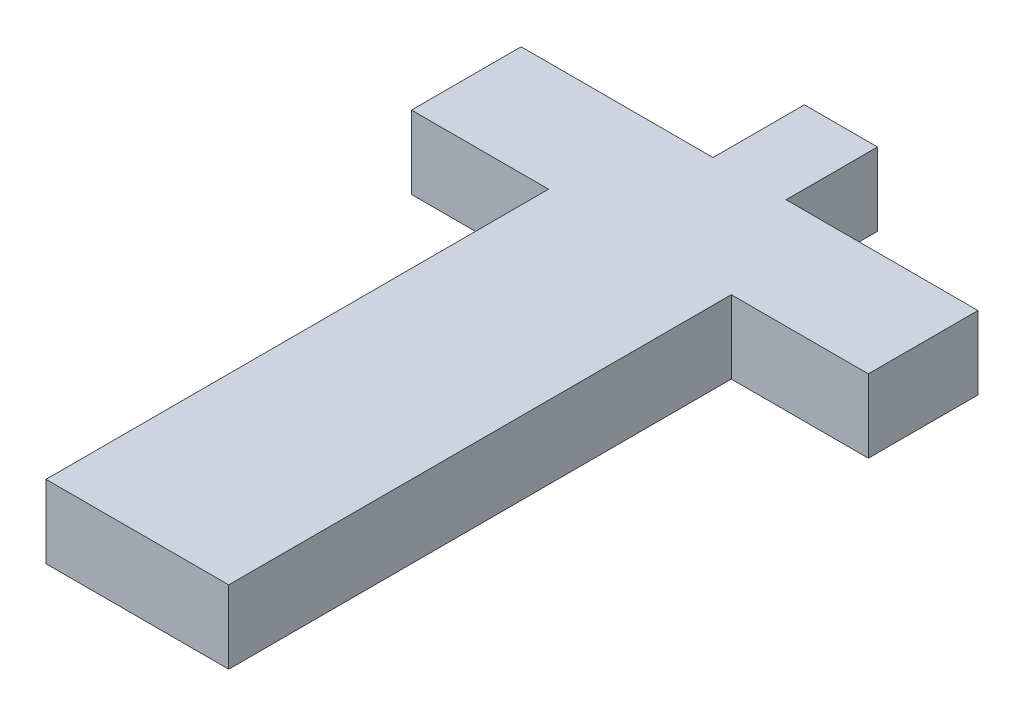
ISO-10303-21;
HEADER;
FILE_DESCRIPTION(('STEP AP214'),'2;1');
FILE_NAME('part.step','',(''),(''),'','','');
FILE_SCHEMA(('AUTOMOTIVE_DESIGN { 1 0 10303 214 1 1 1 1 }'));
ENDSEC;
DATA;
#1=APPLICATION_CONTEXT('core data for automotive mechanical design processes');
#2=APPLICATION_PROTOCOL_DEFINITION('international standard','automotive_design',2000,#1);
#3=PRODUCT_CONTEXT('',#1,'mechanical');
#4=PRODUCT('Part','Part','',(#3));
#5=PRODUCT_RELATED_PRODUCT_CATEGORY('part','',(#4));
#6=PRODUCT_DEFINITION_FORMATION('','',#4);
#7=PRODUCT_DEFINITION_CONTEXT('part definition',#1,'design');
#8=PRODUCT_DEFINITION('design','',#6,#7);
#9=PRODUCT_DEFINITION_SHAPE('','',#8);
#10=(LENGTH_UNIT() NAMED_UNIT(*) SI_UNIT(.MILLI.,.METRE.));
#11=(NAMED_UNIT(*) PLANE_ANGLE_UNIT() SI_UNIT($,.RADIAN.));
#12=(NAMED_UNIT(*) SI_UNIT($,.STERADIAN.) SOLID_ANGLE_UNIT());
#13=UNCERTAINTY_MEASURE_WITH_UNIT(LENGTH_MEASURE(1.E-05),#10,'distance_accuracy_value','');
#14=(GEOMETRIC_REPRESENTATION_CONTEXT(3) GLOBAL_UNCERTAINTY_ASSIGNED_CONTEXT((#13)) GLOBAL_UNIT_ASSIGNED_CONTEXT((#10,
#11,#12)) REPRESENTATION_CONTEXT('',''));
#15=CARTESIAN_POINT('',(0.,0.,0.));
#16=DIRECTION('',(0.,0.,1.));
#17=DIRECTION('',(1.,0.,0.));
#18=AXIS2_PLACEMENT_3D('',#15,#16,#17);
#19=CARTESIAN_POINT('',(-10.,4.,12.));
#20=DIRECTION('',(1.,0.,0.));
#21=DIRECTION('',(0.,0.,-1.));
#22=AXIS2_PLACEMENT_3D('',#19,#20,#21);
#23=PLANE('',#22);
#24=DIRECTION('',(0.,1.,0.));
#25=VECTOR('',#24,1.);
#26=CARTESIAN_POINT('',(-10.,-4.,12.));
#27=LINE('',#26,#25);
#28=CARTESIAN_POINT('',(-10.,-4.,12.));
#29=VERTEX_POINT('',#28);
#30=CARTESIAN_POINT('',(-10.,4.,12.));
#31=VERTEX_POINT('',#30);
#32=EDGE_CURVE('E47',#29,#31,#27,.T.);
#33=ORIENTED_EDGE('',*,*,#32,.F.);
#34=DIRECTION('',(0.,0.,-1.));
#35=VECTOR('',#34,1.);
#36=CARTESIAN_POINT('',(-10.,-4.,12.));
#37=LINE('',#36,#35);
#38=CARTESIAN_POINT('',(-10.,-4.,67.));
#39=VERTEX_POINT('',#38);
#40=EDGE_CURVE('E212',#39,#29,#37,.T.);
#41=ORIENTED_EDGE('',*,*,#40,.F.);
#42=DIRECTION('',(0.,-1.,0.));
#43=VECTOR('',#42,1.);
#44=CARTESIAN_POINT('',(-10.,4.,67.));
#45=LINE('',#44,#43);
#46=CARTESIAN_POINT('',(-10.,4.,67.));
#47=VERTEX_POINT('',#46);
#48=EDGE_CURVE('E172',#47,#39,#45,.T.);
#49=ORIENTED_EDGE('',*,*,#48,.F.);
#50=DIRECTION('',(0.,0.,-1.));
#51=VECTOR('',#50,1.);
#52=CARTESIAN_POINT('',(-10.,4.,12.));
#53=LINE('',#52,#51);
#54=EDGE_CURVE('E40',#47,#31,#53,.T.);
#55=ORIENTED_EDGE('',*,*,#54,.T.);
#56=EDGE_LOOP('',(#33,#41,#49,#55));
#57=FACE_BOUND('',#56,.T.);
#58=ADVANCED_FACE('F32',(#57),#23,.F.);
#59=CARTESIAN_POINT('',(10.,4.,12.));
#60=DIRECTION('',(-1.,0.,0.));
#61=DIRECTION('',(0.,0.,1.));
#62=AXIS2_PLACEMENT_3D('',#59,#60,#61);
#63=PLANE('',#62);
#64=DIRECTION('',(0.,-1.,0.));
#65=VECTOR('',#64,1.);
#66=CARTESIAN_POINT('',(10.,4.,12.));
#67=LINE('',#66,#65);
#68=CARTESIAN_POINT('',(10.,4.,12.));
#69=VERTEX_POINT('',#68);
#70=CARTESIAN_POINT('',(10.,-4.,12.));
#71=VERTEX_POINT('',#70);
#72=EDGE_CURVE('E55',#69,#71,#67,.T.);
#73=ORIENTED_EDGE('',*,*,#72,.F.);
#74=DIRECTION('',(0.,0.,-1.));
#75=VECTOR('',#74,1.);
#76=CARTESIAN_POINT('',(10.,4.,12.));
#77=LINE('',#76,#75);
#78=CARTESIAN_POINT('',(10.,4.,67.));
#79=VERTEX_POINT('',#78);
#80=EDGE_CURVE('E11',#79,#69,#77,.T.);
#81=ORIENTED_EDGE('',*,*,#80,.F.);
#82=DIRECTION('',(0.,1.,0.));
#83=VECTOR('',#82,1.);
#84=CARTESIAN_POINT('',(10.,4.,67.));
#85=LINE('',#84,#83);
#86=CARTESIAN_POINT('',(10.,-4.,67.));
#87=VERTEX_POINT('',#86);
#88=EDGE_CURVE('E166',#87,#79,#85,.T.);
#89=ORIENTED_EDGE('',*,*,#88,.F.);
#90=DIRECTION('',(0.,0.,-1.));
#91=VECTOR('',#90,1.);
#92=CARTESIAN_POINT('',(10.,-4.,12.));
#93=LINE('',#92,#91);
#94=EDGE_CURVE('E210',#87,#71,#93,.T.);
#95=ORIENTED_EDGE('',*,*,#94,.T.);
#96=EDGE_LOOP('',(#73,#81,#89,#95));
#97=FACE_BOUND('',#96,.T.);
#98=ADVANCED_FACE('F34',(#97),#63,.F.);
#99=CARTESIAN_POINT('',(0.,0.,0.));
#100=DIRECTION('',(0.,0.,1.));
#101=DIRECTION('',(1.,0.,0.));
#102=AXIS2_PLACEMENT_3D('',#99,#100,#101);
#103=PLANE('',#102);
#104=DIRECTION('',(0.,1.,0.));
#105=VECTOR('',#104,1.);
#106=CARTESIAN_POINT('',(-4.,-4.,0.));
#107=LINE('',#106,#105);
#108=CARTESIAN_POINT('',(-4.,-4.,0.));
#109=VERTEX_POINT('',#108);
#110=CARTESIAN_POINT('',(-4.,4.,0.));
#111=VERTEX_POINT('',#110);
#112=EDGE_CURVE('E178',#109,#111,#107,.T.);
#113=ORIENTED_EDGE('',*,*,#112,.F.);
#114=DIRECTION('',(1.,0.,0.));
#115=VECTOR('',#114,1.);
#116=CARTESIAN_POINT('',(-10.,-4.,0.));
#117=LINE('',#116,#115);
#118=CARTESIAN_POINT('',(-25.,-4.,0.));
#119=VERTEX_POINT('',#118);
#120=EDGE_CURVE('E207',#119,#109,#117,.T.);
#121=ORIENTED_EDGE('',*,*,#120,.F.);
#122=DIRECTION('',(0.,-1.,0.));
#123=VECTOR('',#122,1.);
#124=CARTESIAN_POINT('',(-25.,-4.,0.));
#125=LINE('',#124,#123);
#126=CARTESIAN_POINT('',(-25.,4.,0.));
#127=VERTEX_POINT('',#126);
#128=EDGE_CURVE('E131',#127,#119,#125,.T.);
#129=ORIENTED_EDGE('',*,*,#128,.F.);
#130=DIRECTION('',(-1.,0.,0.));
#131=VECTOR('',#130,1.);
#132=CARTESIAN_POINT('',(-10.,4.,0.));
#133=LINE('',#132,#131);
#134=EDGE_CURVE('E127',#111,#127,#133,.T.);
#135=ORIENTED_EDGE('',*,*,#134,.F.);
#136=EDGE_LOOP('',(#113,#121,#129,#135));
#137=FACE_BOUND('',#136,.T.);
#138=ADVANCED_FACE('F243',(#137),#103,.F.);
#139=DIRECTION('',(0.,-1.,0.));
#140=VECTOR('',#139,1.);
#141=CARTESIAN_POINT('',(4.,-4.,0.));
#142=LINE('',#141,#140);
#143=CARTESIAN_POINT('',(4.,4.,0.));
#144=VERTEX_POINT('',#143);
#145=CARTESIAN_POINT('',(4.,-4.,0.));
#146=VERTEX_POINT('',#145);
#147=EDGE_CURVE('E183',#144,#146,#142,.T.);
#148=ORIENTED_EDGE('',*,*,#147,.F.);
#149=CARTESIAN_POINT('',(25.,4.,0.));
#150=VERTEX_POINT('',#149);
#151=EDGE_CURVE('E204',#150,#144,#133,.T.);
#152=ORIENTED_EDGE('',*,*,#151,.F.);
#153=DIRECTION('',(0.,1.,0.));
#154=VECTOR('',#153,1.);
#155=CARTESIAN_POINT('',(25.,4.,0.));
#156=LINE('',#155,#154);
#157=CARTESIAN_POINT('',(25.,-4.,0.));
#158=VERTEX_POINT('',#157);
#159=EDGE_CURVE('E155',#158,#150,#156,.T.);
#160=ORIENTED_EDGE('',*,*,#159,.F.);
#161=EDGE_CURVE('E206',#146,#158,#117,.T.);
#162=ORIENTED_EDGE('',*,*,#161,.F.);
#163=EDGE_LOOP('',(#148,#152,#160,#162));
#164=FACE_BOUND('',#163,.T.);
#165=ADVANCED_FACE('F248',(#164),#103,.F.);
#166=CARTESIAN_POINT('',(-10.,4.,12.));
#167=DIRECTION('',(0.,-1.,0.));
#168=DIRECTION('',(0.,0.,-1.));
#169=AXIS2_PLACEMENT_3D('',#166,#167,#168);
#170=PLANE('',#169);
#171=ORIENTED_EDGE('',*,*,#151,.T.);
#172=DIRECTION('',(0.,0.,1.));
#173=VECTOR('',#172,1.);
#174=CARTESIAN_POINT('',(4.,4.,-10.));
#175=LINE('',#174,#173);
#176=CARTESIAN_POINT('',(4.,4.,-10.));
#177=VERTEX_POINT('',#176);
#178=EDGE_CURVE('E199',#177,#144,#175,.T.);
#179=ORIENTED_EDGE('',*,*,#178,.F.);
#180=DIRECTION('',(1.,0.,0.));
#181=VECTOR('',#180,1.);
#182=CARTESIAN_POINT('',(4.,4.,-10.));
#183=LINE('',#182,#181);
#184=CARTESIAN_POINT('',(-4.,4.,-10.));
#185=VERTEX_POINT('',#184);
#186=EDGE_CURVE('E182',#185,#177,#183,.T.);
#187=ORIENTED_EDGE('',*,*,#186,.F.);
#188=DIRECTION('',(0.,0.,1.));
#189=VECTOR('',#188,1.);
#190=CARTESIAN_POINT('',(-4.,4.,-10.));
#191=LINE('',#190,#189);
#192=EDGE_CURVE('E202',#185,#111,#191,.T.);
#193=ORIENTED_EDGE('',*,*,#192,.T.);
#194=ORIENTED_EDGE('',*,*,#134,.T.);
#195=DIRECTION('',(0.,0.,-1.));
#196=VECTOR('',#195,1.);
#197=CARTESIAN_POINT('',(-25.,4.,12.));
#198=LINE('',#197,#196);
#199=CARTESIAN_POINT('',(-25.,4.,12.));
#200=VERTEX_POINT('',#199);
#201=EDGE_CURVE('E120',#200,#127,#198,.T.);
#202=ORIENTED_EDGE('',*,*,#201,.F.);
#203=DIRECTION('',(1.,0.,0.));
#204=VECTOR('',#203,1.);
#205=CARTESIAN_POINT('',(-25.,4.,12.));
#206=LINE('',#205,#204);
#207=EDGE_CURVE('E125',#200,#31,#206,.T.);
#208=ORIENTED_EDGE('',*,*,#207,.T.);
#209=ORIENTED_EDGE('',*,*,#54,.F.);
#210=DIRECTION('',(-1.,0.,0.));
#211=VECTOR('',#210,1.);
#212=CARTESIAN_POINT('',(10.,4.,67.));
#213=LINE('',#212,#211);
#214=EDGE_CURVE('E169',#79,#47,#213,.T.);
#215=ORIENTED_EDGE('',*,*,#214,.F.);
#216=ORIENTED_EDGE('',*,*,#80,.T.);
#217=DIRECTION('',(-1.,0.,0.));
#218=VECTOR('',#217,1.);
#219=CARTESIAN_POINT('',(25.,4.,12.));
#220=LINE('',#219,#218);
#221=CARTESIAN_POINT('',(25.,4.,12.));
#222=VERTEX_POINT('',#221);
#223=EDGE_CURVE('E159',#222,#69,#220,.T.);
#224=ORIENTED_EDGE('',*,*,#223,.F.);
#225=DIRECTION('',(0.,0.,1.));
#226=VECTOR('',#225,1.);
#227=CARTESIAN_POINT('',(25.,4.,12.));
#228=LINE('',#227,#226);
#229=EDGE_CURVE('E158',#150,#222,#228,.T.);
#230=ORIENTED_EDGE('',*,*,#229,.F.);
#231=EDGE_LOOP('',(#171,#179,#187,#193,#194,#202,#208,#209,#215,#216,#224,#230));
#232=FACE_BOUND('',#231,.T.);
#233=ADVANCED_FACE('F123',(#232),#170,.F.);
#234=CARTESIAN_POINT('',(-10.,-4.,12.));
#235=DIRECTION('',(0.,1.,0.));
#236=DIRECTION('',(0.,0.,1.));
#237=AXIS2_PLACEMENT_3D('',#234,#235,#236);
#238=PLANE('',#237);
#239=ORIENTED_EDGE('',*,*,#120,.T.);
#240=DIRECTION('',(0.,0.,1.));
#241=VECTOR('',#240,1.);
#242=CARTESIAN_POINT('',(-4.,-4.,-10.));
#243=LINE('',#242,#241);
#244=CARTESIAN_POINT('',(-4.,-4.,-10.));
#245=VERTEX_POINT('',#244);
#246=EDGE_CURVE('E189',#245,#109,#243,.T.);
#247=ORIENTED_EDGE('',*,*,#246,.F.);
#248=DIRECTION('',(-1.,0.,0.));
#249=VECTOR('',#248,1.);
#250=CARTESIAN_POINT('',(4.,-4.,-10.));
#251=LINE('',#250,#249);
#252=CARTESIAN_POINT('',(4.,-4.,-10.));
#253=VERTEX_POINT('',#252);
#254=EDGE_CURVE('E187',#253,#245,#251,.T.);
#255=ORIENTED_EDGE('',*,*,#254,.F.);
#256=DIRECTION('',(0.,0.,1.));
#257=VECTOR('',#256,1.);
#258=CARTESIAN_POINT('',(4.,-4.,-10.));
#259=LINE('',#258,#257);
#260=EDGE_CURVE('E196',#253,#146,#259,.T.);
#261=ORIENTED_EDGE('',*,*,#260,.T.);
#262=ORIENTED_EDGE('',*,*,#161,.T.);
#263=DIRECTION('',(0.,0.,-1.));
#264=VECTOR('',#263,1.);
#265=CARTESIAN_POINT('',(25.,-4.,12.));
#266=LINE('',#265,#264);
#267=CARTESIAN_POINT('',(25.,-4.,12.));
#268=VERTEX_POINT('',#267);
#269=EDGE_CURVE('E152',#268,#158,#266,.T.);
#270=ORIENTED_EDGE('',*,*,#269,.F.);
#271=DIRECTION('',(-1.,0.,0.));
#272=VECTOR('',#271,1.);
#273=CARTESIAN_POINT('',(25.,-4.,12.));
#274=LINE('',#273,#272);
#275=EDGE_CURVE('E163',#268,#71,#274,.T.);
#276=ORIENTED_EDGE('',*,*,#275,.T.);
#277=ORIENTED_EDGE('',*,*,#94,.F.);
#278=DIRECTION('',(1.,0.,0.));
#279=VECTOR('',#278,1.);
#280=CARTESIAN_POINT('',(10.,-4.,67.));
#281=LINE('',#280,#279);
#282=EDGE_CURVE('E175',#39,#87,#281,.T.);
#283=ORIENTED_EDGE('',*,*,#282,.F.);
#284=ORIENTED_EDGE('',*,*,#40,.T.);
#285=DIRECTION('',(1.,0.,0.));
#286=VECTOR('',#285,1.);
#287=CARTESIAN_POINT('',(-25.,-4.,12.));
#288=LINE('',#287,#286);
#289=CARTESIAN_POINT('',(-25.,-4.,12.));
#290=VERTEX_POINT('',#289);
#291=EDGE_CURVE('E143',#290,#29,#288,.T.);
#292=ORIENTED_EDGE('',*,*,#291,.F.);
#293=DIRECTION('',(0.,0.,1.));
#294=VECTOR('',#293,1.);
#295=CARTESIAN_POINT('',(-25.,-4.,12.));
#296=LINE('',#295,#294);
#297=EDGE_CURVE('E137',#119,#290,#296,.T.);
#298=ORIENTED_EDGE('',*,*,#297,.F.);
#299=EDGE_LOOP('',(#239,#247,#255,#261,#262,#270,#276,#277,#283,#284,#292,#298));
#300=FACE_BOUND('',#299,.T.);
#301=ADVANCED_FACE('F245',(#300),#238,.F.);
#302=CARTESIAN_POINT('',(-4.,-4.,-10.));
#303=DIRECTION('',(1.,0.,0.));
#304=DIRECTION('',(0.,0.,-1.));
#305=AXIS2_PLACEMENT_3D('',#302,#303,#304);
#306=PLANE('',#305);
#307=ORIENTED_EDGE('',*,*,#112,.T.);
#308=ORIENTED_EDGE('',*,*,#192,.F.);
#309=DIRECTION('',(0.,1.,0.));
#310=VECTOR('',#309,1.);
#311=CARTESIAN_POINT('',(-4.,-4.,-10.));
#312=LINE('',#311,#310);
#313=EDGE_CURVE('E179',#245,#185,#312,.T.);
#314=ORIENTED_EDGE('',*,*,#313,.F.);
#315=ORIENTED_EDGE('',*,*,#246,.T.);
#316=EDGE_LOOP('',(#307,#308,#314,#315));
#317=FACE_BOUND('',#316,.T.);
#318=ADVANCED_FACE('F241',(#317),#306,.F.);
#319=CARTESIAN_POINT('',(4.,-4.,-10.));
#320=DIRECTION('',(-1.,0.,0.));
#321=DIRECTION('',(0.,0.,1.));
#322=AXIS2_PLACEMENT_3D('',#319,#320,#321);
#323=PLANE('',#322);
#324=ORIENTED_EDGE('',*,*,#147,.T.);
#325=ORIENTED_EDGE('',*,*,#260,.F.);
#326=DIRECTION('',(0.,-1.,0.));
#327=VECTOR('',#326,1.);
#328=CARTESIAN_POINT('',(4.,-4.,-10.));
#329=LINE('',#328,#327);
#330=EDGE_CURVE('E185',#177,#253,#329,.T.);
#331=ORIENTED_EDGE('',*,*,#330,.F.);
#332=ORIENTED_EDGE('',*,*,#178,.T.);
#333=EDGE_LOOP('',(#324,#325,#331,#332));
#334=FACE_BOUND('',#333,.T.);
#335=ADVANCED_FACE('F232',(#334),#323,.F.);
#336=CARTESIAN_POINT('',(0.,0.,-10.));
#337=DIRECTION('',(0.,0.,1.));
#338=DIRECTION('',(1.,0.,0.));
#339=AXIS2_PLACEMENT_3D('',#336,#337,#338);
#340=PLANE('',#339);
#341=ORIENTED_EDGE('',*,*,#313,.T.);
#342=ORIENTED_EDGE('',*,*,#186,.T.);
#343=ORIENTED_EDGE('',*,*,#330,.T.);
#344=ORIENTED_EDGE('',*,*,#254,.T.);
#345=EDGE_LOOP('',(#341,#342,#343,#344));
#346=FACE_BOUND('',#345,.T.);
#347=ADVANCED_FACE('F236',(#346),#340,.F.);
#348=CARTESIAN_POINT('',(0.,0.,67.));
#349=DIRECTION('',(0.,0.,-1.));
#350=DIRECTION('',(-1.,0.,0.));
#351=AXIS2_PLACEMENT_3D('',#348,#349,#350);
#352=PLANE('',#351);
#353=ORIENTED_EDGE('',*,*,#88,.T.);
#354=ORIENTED_EDGE('',*,*,#214,.T.);
#355=ORIENTED_EDGE('',*,*,#48,.T.);
#356=ORIENTED_EDGE('',*,*,#282,.T.);
#357=EDGE_LOOP('',(#353,#354,#355,#356));
#358=FACE_BOUND('',#357,.T.);
#359=ADVANCED_FACE('F216',(#358),#352,.F.);
#360=CARTESIAN_POINT('',(25.,4.,12.));
#361=DIRECTION('',(0.,0.,-1.));
#362=DIRECTION('',(-1.,0.,0.));
#363=AXIS2_PLACEMENT_3D('',#360,#361,#362);
#364=PLANE('',#363);
#365=ORIENTED_EDGE('',*,*,#72,.T.);
#366=ORIENTED_EDGE('',*,*,#275,.F.);
#367=DIRECTION('',(0.,-1.,0.));
#368=VECTOR('',#367,1.);
#369=CARTESIAN_POINT('',(25.,4.,12.));
#370=LINE('',#369,#368);
#371=EDGE_CURVE('E145',#222,#268,#370,.T.);
#372=ORIENTED_EDGE('',*,*,#371,.F.);
#373=ORIENTED_EDGE('',*,*,#223,.T.);
#374=EDGE_LOOP('',(#365,#366,#372,#373));
#375=FACE_BOUND('',#374,.T.);
#376=ADVANCED_FACE('F223',(#375),#364,.F.);
#377=CARTESIAN_POINT('',(25.,0.,0.));
#378=DIRECTION('',(1.,0.,0.));
#379=DIRECTION('',(0.,0.,-1.));
#380=AXIS2_PLACEMENT_3D('',#377,#378,#379);
#381=PLANE('',#380);
#382=ORIENTED_EDGE('',*,*,#371,.T.);
#383=ORIENTED_EDGE('',*,*,#269,.T.);
#384=ORIENTED_EDGE('',*,*,#159,.T.);
#385=ORIENTED_EDGE('',*,*,#229,.T.);
#386=EDGE_LOOP('',(#382,#383,#384,#385));
#387=FACE_BOUND('',#386,.T.);
#388=ADVANCED_FACE('F226',(#387),#381,.T.);
#389=CARTESIAN_POINT('',(-25.,-4.,12.));
#390=DIRECTION('',(0.,0.,-1.));
#391=DIRECTION('',(-1.,0.,0.));
#392=AXIS2_PLACEMENT_3D('',#389,#390,#391);
#393=PLANE('',#392);
#394=ORIENTED_EDGE('',*,*,#32,.T.);
#395=ORIENTED_EDGE('',*,*,#207,.F.);
#396=DIRECTION('',(0.,1.,0.));
#397=VECTOR('',#396,1.);
#398=CARTESIAN_POINT('',(-25.,-4.,12.));
#399=LINE('',#398,#397);
#400=EDGE_CURVE('E132',#290,#200,#399,.T.);
#401=ORIENTED_EDGE('',*,*,#400,.F.);
#402=ORIENTED_EDGE('',*,*,#291,.T.);
#403=EDGE_LOOP('',(#394,#395,#401,#402));
#404=FACE_BOUND('',#403,.T.);
#405=ADVANCED_FACE('F142',(#404),#393,.F.);
#406=CARTESIAN_POINT('',(-25.,0.,0.));
#407=DIRECTION('',(-1.,0.,0.));
#408=DIRECTION('',(0.,0.,1.));
#409=AXIS2_PLACEMENT_3D('',#406,#407,#408);
#410=PLANE('',#409);
#411=ORIENTED_EDGE('',*,*,#400,.T.);
#412=ORIENTED_EDGE('',*,*,#201,.T.);
#413=ORIENTED_EDGE('',*,*,#128,.T.);
#414=ORIENTED_EDGE('',*,*,#297,.T.);
#415=EDGE_LOOP('',(#411,#412,#413,#414));
#416=FACE_BOUND('',#415,.T.);
#417=ADVANCED_FACE('F135',(#416),#410,.T.);
#418=CLOSED_SHELL('',(#58,#98,#138,#165,#233,#301,#318,#335,#347,#359,#376,#388,#405,#417));
#419=MANIFOLD_SOLID_BREP('B2',#418);
#420=ADVANCED_BREP_SHAPE_REPRESENTATION('',(#18,#419),#14);
#421=SHAPE_DEFINITION_REPRESENTATION(#9,#420);
ENDSEC;
END-ISO-10303-21;
